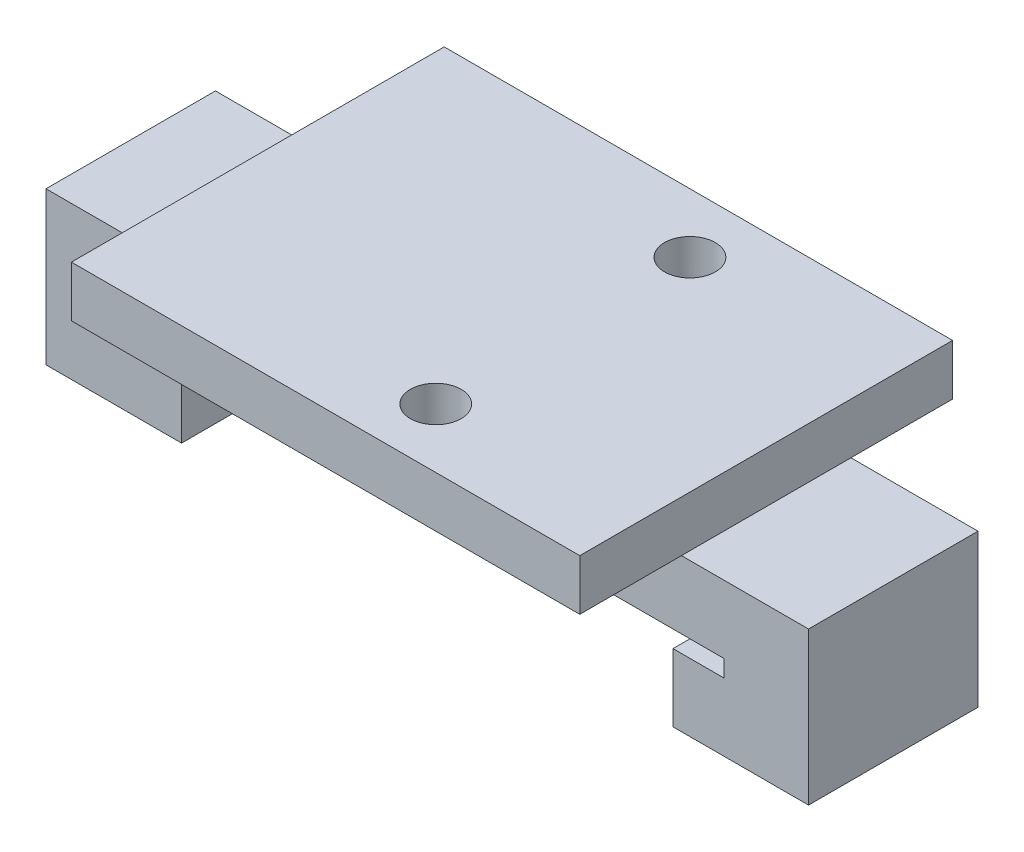
ISO-10303-21;
HEADER;
FILE_DESCRIPTION(('STEP AP214'),'2;1');
FILE_NAME('part.step','',(''),(''),'','','');
FILE_SCHEMA(('AUTOMOTIVE_DESIGN { 1 0 10303 214 1 1 1 1 }'));
ENDSEC;
DATA;
#1=APPLICATION_CONTEXT('core data for automotive mechanical design processes');
#2=APPLICATION_PROTOCOL_DEFINITION('international standard','automotive_design',2000,#1);
#3=PRODUCT_CONTEXT('',#1,'mechanical');
#4=PRODUCT('Part','Part','',(#3));
#5=PRODUCT_RELATED_PRODUCT_CATEGORY('part','',(#4));
#6=PRODUCT_DEFINITION_FORMATION('','',#4);
#7=PRODUCT_DEFINITION_CONTEXT('part definition',#1,'design');
#8=PRODUCT_DEFINITION('design','',#6,#7);
#9=PRODUCT_DEFINITION_SHAPE('','',#8);
#10=(LENGTH_UNIT() NAMED_UNIT(*) SI_UNIT(.MILLI.,.METRE.));
#11=(NAMED_UNIT(*) PLANE_ANGLE_UNIT() SI_UNIT($,.RADIAN.));
#12=(NAMED_UNIT(*) SI_UNIT($,.STERADIAN.) SOLID_ANGLE_UNIT());
#13=UNCERTAINTY_MEASURE_WITH_UNIT(LENGTH_MEASURE(1.E-05),#10,'distance_accuracy_value','');
#14=(GEOMETRIC_REPRESENTATION_CONTEXT(3) GLOBAL_UNCERTAINTY_ASSIGNED_CONTEXT((#13)) GLOBAL_UNIT_ASSIGNED_CONTEXT((#10,
#11,#12)) REPRESENTATION_CONTEXT('',''));
#15=CARTESIAN_POINT('',(0.,0.,0.));
#16=DIRECTION('',(0.,0.,1.));
#17=DIRECTION('',(1.,0.,0.));
#18=AXIS2_PLACEMENT_3D('',#15,#16,#17);
#19=CARTESIAN_POINT('',(-22.5,4.,10.));
#20=DIRECTION('',(0.,-1.,0.));
#21=DIRECTION('',(1.,0.,0.));
#22=AXIS2_PLACEMENT_3D('',#19,#20,#21);
#23=PLANE('',#22);
#24=DIRECTION('',(0.,0.,-1.));
#25=VECTOR('',#24,1.);
#26=CARTESIAN_POINT('',(15.,4.,16.));
#27=LINE('',#26,#25);
#28=CARTESIAN_POINT('',(15.,4.,10.));
#29=VERTEX_POINT('',#28);
#30=CARTESIAN_POINT('',(15.,4.,0.));
#31=VERTEX_POINT('',#30);
#32=EDGE_CURVE('E11',#29,#31,#27,.T.);
#33=ORIENTED_EDGE('',*,*,#32,.F.);
#34=DIRECTION('',(-1.,0.,0.));
#35=VECTOR('',#34,1.);
#36=CARTESIAN_POINT('',(-22.5,4.,10.));
#37=LINE('',#36,#35);
#38=CARTESIAN_POINT('',(22.5,4.,10.));
#39=VERTEX_POINT('',#38);
#40=EDGE_CURVE('E233',#39,#29,#37,.T.);
#41=ORIENTED_EDGE('',*,*,#40,.F.);
#42=DIRECTION('',(0.,0.,-1.));
#43=VECTOR('',#42,1.);
#44=CARTESIAN_POINT('',(22.5,4.,10.));
#45=LINE('',#44,#43);
#46=CARTESIAN_POINT('',(22.5,4.,0.));
#47=VERTEX_POINT('',#46);
#48=EDGE_CURVE('E309',#39,#47,#45,.T.);
#49=ORIENTED_EDGE('',*,*,#48,.T.);
#50=DIRECTION('',(-1.,0.,0.));
#51=VECTOR('',#50,1.);
#52=CARTESIAN_POINT('',(-22.5,4.,0.));
#53=LINE('',#52,#51);
#54=EDGE_CURVE('E268',#47,#31,#53,.T.);
#55=ORIENTED_EDGE('',*,*,#54,.T.);
#56=EDGE_LOOP('',(#33,#41,#49,#55));
#57=FACE_BOUND('',#56,.T.);
#58=ADVANCED_FACE('F43',(#57),#23,.F.);
#59=DIRECTION('',(0.,0.,1.));
#60=VECTOR('',#59,1.);
#61=CARTESIAN_POINT('',(-15.,4.,16.));
#62=LINE('',#61,#60);
#63=CARTESIAN_POINT('',(-15.,4.,0.));
#64=VERTEX_POINT('',#63);
#65=CARTESIAN_POINT('',(-15.,4.,10.));
#66=VERTEX_POINT('',#65);
#67=EDGE_CURVE('E53',#64,#66,#62,.T.);
#68=ORIENTED_EDGE('',*,*,#67,.F.);
#69=CARTESIAN_POINT('',(-22.5,4.,0.));
#70=VERTEX_POINT('',#69);
#71=EDGE_CURVE('E267',#64,#70,#53,.T.);
#72=ORIENTED_EDGE('',*,*,#71,.T.);
#73=DIRECTION('',(0.,0.,-1.));
#74=VECTOR('',#73,1.);
#75=CARTESIAN_POINT('',(-22.5,4.,10.));
#76=LINE('',#75,#74);
#77=CARTESIAN_POINT('',(-22.5,4.,10.));
#78=VERTEX_POINT('',#77);
#79=EDGE_CURVE('E305',#78,#70,#76,.T.);
#80=ORIENTED_EDGE('',*,*,#79,.F.);
#81=EDGE_CURVE('E232',#66,#78,#37,.T.);
#82=ORIENTED_EDGE('',*,*,#81,.F.);
#83=EDGE_LOOP('',(#68,#72,#80,#82));
#84=FACE_BOUND('',#83,.T.);
#85=ADVANCED_FACE('F393',(#84),#23,.F.);
#86=CARTESIAN_POINT('',(17.5,0.,10.));
#87=DIRECTION('',(0.,1.,0.));
#88=DIRECTION('',(-1.,0.,0.));
#89=AXIS2_PLACEMENT_3D('',#86,#87,#88);
#90=PLANE('',#89);
#91=DIRECTION('',(1.,0.,0.));
#92=VECTOR('',#91,1.);
#93=CARTESIAN_POINT('',(17.5,0.,0.));
#94=LINE('',#93,#92);
#95=CARTESIAN_POINT('',(-17.5,0.,0.));
#96=VERTEX_POINT('',#95);
#97=CARTESIAN_POINT('',(17.5,0.,0.));
#98=VERTEX_POINT('',#97);
#99=EDGE_CURVE('E201',#96,#98,#94,.T.);
#100=ORIENTED_EDGE('',*,*,#99,.T.);
#101=DIRECTION('',(0.,0.,-1.));
#102=VECTOR('',#101,1.);
#103=CARTESIAN_POINT('',(17.5,0.,10.));
#104=LINE('',#103,#102);
#105=CARTESIAN_POINT('',(17.5,0.,10.));
#106=VERTEX_POINT('',#105);
#107=EDGE_CURVE('E328',#106,#98,#104,.T.);
#108=ORIENTED_EDGE('',*,*,#107,.F.);
#109=DIRECTION('',(1.,0.,0.));
#110=VECTOR('',#109,1.);
#111=CARTESIAN_POINT('',(17.5,0.,10.));
#112=LINE('',#111,#110);
#113=CARTESIAN_POINT('',(-17.5,0.,10.));
#114=VERTEX_POINT('',#113);
#115=EDGE_CURVE('E212',#114,#106,#112,.T.);
#116=ORIENTED_EDGE('',*,*,#115,.F.);
#117=DIRECTION('',(0.,0.,-1.));
#118=VECTOR('',#117,1.);
#119=CARTESIAN_POINT('',(-17.5,0.,10.));
#120=LINE('',#119,#118);
#121=EDGE_CURVE('E251',#114,#96,#120,.T.);
#122=ORIENTED_EDGE('',*,*,#121,.T.);
#123=EDGE_LOOP('',(#100,#108,#116,#122));
#124=FACE_BOUND('',#123,.T.);
#125=ADVANCED_FACE('F45',(#124),#90,.F.);
#126=CARTESIAN_POINT('',(17.5,-1.,10.));
#127=DIRECTION('',(1.,0.,0.));
#128=DIRECTION('',(0.,0.,-1.));
#129=AXIS2_PLACEMENT_3D('',#126,#127,#128);
#130=PLANE('',#129);
#131=DIRECTION('',(0.,-1.,0.));
#132=VECTOR('',#131,1.);
#133=CARTESIAN_POINT('',(17.5,-1.,0.));
#134=LINE('',#133,#132);
#135=CARTESIAN_POINT('',(17.5,-1.,0.));
#136=VERTEX_POINT('',#135);
#137=EDGE_CURVE('E206',#98,#136,#134,.T.);
#138=ORIENTED_EDGE('',*,*,#137,.T.);
#139=DIRECTION('',(0.,0.,-1.));
#140=VECTOR('',#139,1.);
#141=CARTESIAN_POINT('',(17.5,-1.,10.));
#142=LINE('',#141,#140);
#143=CARTESIAN_POINT('',(17.5,-1.,10.));
#144=VERTEX_POINT('',#143);
#145=EDGE_CURVE('E325',#144,#136,#142,.T.);
#146=ORIENTED_EDGE('',*,*,#145,.F.);
#147=DIRECTION('',(0.,-1.,0.));
#148=VECTOR('',#147,1.);
#149=CARTESIAN_POINT('',(17.5,-1.,10.));
#150=LINE('',#149,#148);
#151=EDGE_CURVE('E216',#106,#144,#150,.T.);
#152=ORIENTED_EDGE('',*,*,#151,.F.);
#153=ORIENTED_EDGE('',*,*,#107,.T.);
#154=EDGE_LOOP('',(#138,#146,#152,#153));
#155=FACE_BOUND('',#154,.T.);
#156=ADVANCED_FACE('F425',(#155),#130,.F.);
#157=CARTESIAN_POINT('',(14.5,-1.,10.));
#158=DIRECTION('',(0.,-1.,0.));
#159=DIRECTION('',(0.,0.,-1.));
#160=AXIS2_PLACEMENT_3D('',#157,#158,#159);
#161=PLANE('',#160);
#162=DIRECTION('',(-1.,0.,0.));
#163=VECTOR('',#162,1.);
#164=CARTESIAN_POINT('',(14.5,-1.,0.));
#165=LINE('',#164,#163);
#166=CARTESIAN_POINT('',(14.5,-1.,0.));
#167=VERTEX_POINT('',#166);
#168=EDGE_CURVE('E255',#136,#167,#165,.T.);
#169=ORIENTED_EDGE('',*,*,#168,.T.);
#170=DIRECTION('',(0.,0.,-1.));
#171=VECTOR('',#170,1.);
#172=CARTESIAN_POINT('',(14.5,-1.,10.));
#173=LINE('',#172,#171);
#174=CARTESIAN_POINT('',(14.5,-1.,10.));
#175=VERTEX_POINT('',#174);
#176=EDGE_CURVE('E321',#175,#167,#173,.T.);
#177=ORIENTED_EDGE('',*,*,#176,.F.);
#178=DIRECTION('',(-1.,0.,0.));
#179=VECTOR('',#178,1.);
#180=CARTESIAN_POINT('',(14.5,-1.,10.));
#181=LINE('',#180,#179);
#182=EDGE_CURVE('E220',#144,#175,#181,.T.);
#183=ORIENTED_EDGE('',*,*,#182,.F.);
#184=ORIENTED_EDGE('',*,*,#145,.T.);
#185=EDGE_LOOP('',(#169,#177,#183,#184));
#186=FACE_BOUND('',#185,.T.);
#187=ADVANCED_FACE('F428',(#186),#161,.F.);
#188=CARTESIAN_POINT('',(14.5,-5.,10.));
#189=DIRECTION('',(1.,0.,0.));
#190=DIRECTION('',(0.,0.,-1.));
#191=AXIS2_PLACEMENT_3D('',#188,#189,#190);
#192=PLANE('',#191);
#193=DIRECTION('',(0.,-1.,0.));
#194=VECTOR('',#193,1.);
#195=CARTESIAN_POINT('',(14.5,-5.,0.));
#196=LINE('',#195,#194);
#197=CARTESIAN_POINT('',(14.5,-5.,0.));
#198=VERTEX_POINT('',#197);
#199=EDGE_CURVE('E258',#167,#198,#196,.T.);
#200=ORIENTED_EDGE('',*,*,#199,.T.);
#201=DIRECTION('',(0.,0.,-1.));
#202=VECTOR('',#201,1.);
#203=CARTESIAN_POINT('',(14.5,-5.,10.));
#204=LINE('',#203,#202);
#205=CARTESIAN_POINT('',(14.5,-5.,10.));
#206=VERTEX_POINT('',#205);
#207=EDGE_CURVE('E317',#206,#198,#204,.T.);
#208=ORIENTED_EDGE('',*,*,#207,.F.);
#209=DIRECTION('',(0.,-1.,0.));
#210=VECTOR('',#209,1.);
#211=CARTESIAN_POINT('',(14.5,-5.,10.));
#212=LINE('',#211,#210);
#213=EDGE_CURVE('E223',#175,#206,#212,.T.);
#214=ORIENTED_EDGE('',*,*,#213,.F.);
#215=ORIENTED_EDGE('',*,*,#176,.T.);
#216=EDGE_LOOP('',(#200,#208,#214,#215));
#217=FACE_BOUND('',#216,.T.);
#218=ADVANCED_FACE('F435',(#217),#192,.F.);
#219=CARTESIAN_POINT('',(22.5,-5.,10.));
#220=DIRECTION('',(0.,1.,0.));
#221=DIRECTION('',(-1.,0.,0.));
#222=AXIS2_PLACEMENT_3D('',#219,#220,#221);
#223=PLANE('',#222);
#224=DIRECTION('',(1.,0.,0.));
#225=VECTOR('',#224,1.);
#226=CARTESIAN_POINT('',(22.5,-5.,0.));
#227=LINE('',#226,#225);
#228=CARTESIAN_POINT('',(22.5,-5.,0.));
#229=VERTEX_POINT('',#228);
#230=EDGE_CURVE('E261',#198,#229,#227,.T.);
#231=ORIENTED_EDGE('',*,*,#230,.T.);
#232=DIRECTION('',(0.,0.,-1.));
#233=VECTOR('',#232,1.);
#234=CARTESIAN_POINT('',(22.5,-5.,10.));
#235=LINE('',#234,#233);
#236=CARTESIAN_POINT('',(22.5,-5.,10.));
#237=VERTEX_POINT('',#236);
#238=EDGE_CURVE('E313',#237,#229,#235,.T.);
#239=ORIENTED_EDGE('',*,*,#238,.F.);
#240=DIRECTION('',(1.,0.,0.));
#241=VECTOR('',#240,1.);
#242=CARTESIAN_POINT('',(22.5,-5.,10.));
#243=LINE('',#242,#241);
#244=EDGE_CURVE('E226',#206,#237,#243,.T.);
#245=ORIENTED_EDGE('',*,*,#244,.F.);
#246=ORIENTED_EDGE('',*,*,#207,.T.);
#247=EDGE_LOOP('',(#231,#239,#245,#246));
#248=FACE_BOUND('',#247,.T.);
#249=ADVANCED_FACE('F438',(#248),#223,.F.);
#250=CARTESIAN_POINT('',(22.5,4.,10.));
#251=DIRECTION('',(-1.,0.,0.));
#252=DIRECTION('',(0.,0.,1.));
#253=AXIS2_PLACEMENT_3D('',#250,#251,#252);
#254=PLANE('',#253);
#255=DIRECTION('',(0.,1.,0.));
#256=VECTOR('',#255,1.);
#257=CARTESIAN_POINT('',(22.5,4.,0.));
#258=LINE('',#257,#256);
#259=EDGE_CURVE('E264',#229,#47,#258,.T.);
#260=ORIENTED_EDGE('',*,*,#259,.T.);
#261=ORIENTED_EDGE('',*,*,#48,.F.);
#262=DIRECTION('',(0.,1.,0.));
#263=VECTOR('',#262,1.);
#264=CARTESIAN_POINT('',(22.5,4.,10.));
#265=LINE('',#264,#263);
#266=EDGE_CURVE('E229',#237,#39,#265,.T.);
#267=ORIENTED_EDGE('',*,*,#266,.F.);
#268=ORIENTED_EDGE('',*,*,#238,.T.);
#269=EDGE_LOOP('',(#260,#261,#267,#268));
#270=FACE_BOUND('',#269,.T.);
#271=ADVANCED_FACE('F443',(#270),#254,.F.);
#272=CARTESIAN_POINT('',(-22.5,-5.,10.));
#273=DIRECTION('',(1.,0.,0.));
#274=DIRECTION('',(0.,0.,-1.));
#275=AXIS2_PLACEMENT_3D('',#272,#273,#274);
#276=PLANE('',#275);
#277=DIRECTION('',(0.,-1.,0.));
#278=VECTOR('',#277,1.);
#279=CARTESIAN_POINT('',(-22.5,-5.,0.));
#280=LINE('',#279,#278);
#281=CARTESIAN_POINT('',(-22.5,-5.,0.));
#282=VERTEX_POINT('',#281);
#283=EDGE_CURVE('E271',#70,#282,#280,.T.);
#284=ORIENTED_EDGE('',*,*,#283,.T.);
#285=DIRECTION('',(0.,0.,-1.));
#286=VECTOR('',#285,1.);
#287=CARTESIAN_POINT('',(-22.5,-5.,10.));
#288=LINE('',#287,#286);
#289=CARTESIAN_POINT('',(-22.5,-5.,10.));
#290=VERTEX_POINT('',#289);
#291=EDGE_CURVE('E301',#290,#282,#288,.T.);
#292=ORIENTED_EDGE('',*,*,#291,.F.);
#293=DIRECTION('',(0.,-1.,0.));
#294=VECTOR('',#293,1.);
#295=CARTESIAN_POINT('',(-22.5,0.,10.));
#296=LINE('',#295,#294);
#297=EDGE_CURVE('E236',#78,#290,#296,.T.);
#298=ORIENTED_EDGE('',*,*,#297,.F.);
#299=ORIENTED_EDGE('',*,*,#79,.T.);
#300=EDGE_LOOP('',(#284,#292,#298,#299));
#301=FACE_BOUND('',#300,.T.);
#302=ADVANCED_FACE('F396',(#301),#276,.F.);
#303=CARTESIAN_POINT('',(-14.5,-5.,10.));
#304=DIRECTION('',(0.,1.,0.));
#305=DIRECTION('',(0.,0.,1.));
#306=AXIS2_PLACEMENT_3D('',#303,#304,#305);
#307=PLANE('',#306);
#308=DIRECTION('',(1.,0.,0.));
#309=VECTOR('',#308,1.);
#310=CARTESIAN_POINT('',(-14.5,-5.,0.));
#311=LINE('',#310,#309);
#312=CARTESIAN_POINT('',(-14.5,-5.,0.));
#313=VERTEX_POINT('',#312);
#314=EDGE_CURVE('E275',#282,#313,#311,.T.);
#315=ORIENTED_EDGE('',*,*,#314,.T.);
#316=DIRECTION('',(0.,0.,-1.));
#317=VECTOR('',#316,1.);
#318=CARTESIAN_POINT('',(-14.5,-5.,10.));
#319=LINE('',#318,#317);
#320=CARTESIAN_POINT('',(-14.5,-5.,10.));
#321=VERTEX_POINT('',#320);
#322=EDGE_CURVE('E297',#321,#313,#319,.T.);
#323=ORIENTED_EDGE('',*,*,#322,.F.);
#324=DIRECTION('',(1.,0.,0.));
#325=VECTOR('',#324,1.);
#326=CARTESIAN_POINT('',(-14.5,-5.,10.));
#327=LINE('',#326,#325);
#328=EDGE_CURVE('E240',#290,#321,#327,.T.);
#329=ORIENTED_EDGE('',*,*,#328,.F.);
#330=ORIENTED_EDGE('',*,*,#291,.T.);
#331=EDGE_LOOP('',(#315,#323,#329,#330));
#332=FACE_BOUND('',#331,.T.);
#333=ADVANCED_FACE('F401',(#332),#307,.F.);
#334=CARTESIAN_POINT('',(-14.5,-1.,10.));
#335=DIRECTION('',(-1.,0.,0.));
#336=DIRECTION('',(0.,0.,1.));
#337=AXIS2_PLACEMENT_3D('',#334,#335,#336);
#338=PLANE('',#337);
#339=DIRECTION('',(0.,1.,0.));
#340=VECTOR('',#339,1.);
#341=CARTESIAN_POINT('',(-14.5,-1.,0.));
#342=LINE('',#341,#340);
#343=CARTESIAN_POINT('',(-14.5,-1.,0.));
#344=VERTEX_POINT('',#343);
#345=EDGE_CURVE('E278',#313,#344,#342,.T.);
#346=ORIENTED_EDGE('',*,*,#345,.T.);
#347=DIRECTION('',(0.,0.,-1.));
#348=VECTOR('',#347,1.);
#349=CARTESIAN_POINT('',(-14.5,-1.,10.));
#350=LINE('',#349,#348);
#351=CARTESIAN_POINT('',(-14.5,-1.,10.));
#352=VERTEX_POINT('',#351);
#353=EDGE_CURVE('E293',#352,#344,#350,.T.);
#354=ORIENTED_EDGE('',*,*,#353,.F.);
#355=DIRECTION('',(0.,1.,0.));
#356=VECTOR('',#355,1.);
#357=CARTESIAN_POINT('',(-14.5,-1.,10.));
#358=LINE('',#357,#356);
#359=EDGE_CURVE('E243',#321,#352,#358,.T.);
#360=ORIENTED_EDGE('',*,*,#359,.F.);
#361=ORIENTED_EDGE('',*,*,#322,.T.);
#362=EDGE_LOOP('',(#346,#354,#360,#361));
#363=FACE_BOUND('',#362,.T.);
#364=ADVANCED_FACE('F407',(#363),#338,.F.);
#365=CARTESIAN_POINT('',(-17.5,-1.,10.));
#366=DIRECTION('',(0.,-1.,0.));
#367=DIRECTION('',(0.,0.,-1.));
#368=AXIS2_PLACEMENT_3D('',#365,#366,#367);
#369=PLANE('',#368);
#370=DIRECTION('',(-1.,0.,0.));
#371=VECTOR('',#370,1.);
#372=CARTESIAN_POINT('',(-17.5,-1.,0.));
#373=LINE('',#372,#371);
#374=CARTESIAN_POINT('',(-17.5,-1.,0.));
#375=VERTEX_POINT('',#374);
#376=EDGE_CURVE('E281',#344,#375,#373,.T.);
#377=ORIENTED_EDGE('',*,*,#376,.T.);
#378=DIRECTION('',(0.,0.,-1.));
#379=VECTOR('',#378,1.);
#380=CARTESIAN_POINT('',(-17.5,-1.,10.));
#381=LINE('',#380,#379);
#382=CARTESIAN_POINT('',(-17.5,-1.,10.));
#383=VERTEX_POINT('',#382);
#384=EDGE_CURVE('E289',#383,#375,#381,.T.);
#385=ORIENTED_EDGE('',*,*,#384,.F.);
#386=DIRECTION('',(-1.,0.,0.));
#387=VECTOR('',#386,1.);
#388=CARTESIAN_POINT('',(-17.5,-1.,10.));
#389=LINE('',#388,#387);
#390=EDGE_CURVE('E246',#352,#383,#389,.T.);
#391=ORIENTED_EDGE('',*,*,#390,.F.);
#392=ORIENTED_EDGE('',*,*,#353,.T.);
#393=EDGE_LOOP('',(#377,#385,#391,#392));
#394=FACE_BOUND('',#393,.T.);
#395=ADVANCED_FACE('F411',(#394),#369,.F.);
#396=CARTESIAN_POINT('',(-17.5,0.,10.));
#397=DIRECTION('',(-1.,0.,0.));
#398=DIRECTION('',(0.,0.,1.));
#399=AXIS2_PLACEMENT_3D('',#396,#397,#398);
#400=PLANE('',#399);
#401=DIRECTION('',(0.,1.,0.));
#402=VECTOR('',#401,1.);
#403=CARTESIAN_POINT('',(-17.5,0.,0.));
#404=LINE('',#403,#402);
#405=EDGE_CURVE('E217',#375,#96,#404,.T.);
#406=ORIENTED_EDGE('',*,*,#405,.T.);
#407=ORIENTED_EDGE('',*,*,#121,.F.);
#408=DIRECTION('',(0.,1.,0.));
#409=VECTOR('',#408,1.);
#410=CARTESIAN_POINT('',(-17.5,0.,10.));
#411=LINE('',#410,#409);
#412=EDGE_CURVE('E249',#383,#114,#411,.T.);
#413=ORIENTED_EDGE('',*,*,#412,.F.);
#414=ORIENTED_EDGE('',*,*,#384,.T.);
#415=EDGE_LOOP('',(#406,#407,#413,#414));
#416=FACE_BOUND('',#415,.T.);
#417=ADVANCED_FACE('F416',(#416),#400,.F.);
#418=CARTESIAN_POINT('',(0.,0.,10.));
#419=DIRECTION('',(0.,0.,1.));
#420=DIRECTION('',(1.,0.,0.));
#421=AXIS2_PLACEMENT_3D('',#418,#419,#420);
#422=PLANE('',#421);
#423=ORIENTED_EDGE('',*,*,#115,.T.);
#424=ORIENTED_EDGE('',*,*,#151,.T.);
#425=ORIENTED_EDGE('',*,*,#182,.T.);
#426=ORIENTED_EDGE('',*,*,#213,.T.);
#427=ORIENTED_EDGE('',*,*,#244,.T.);
#428=ORIENTED_EDGE('',*,*,#266,.T.);
#429=ORIENTED_EDGE('',*,*,#40,.T.);
#430=EDGE_CURVE('E237',#29,#66,#37,.T.);
#431=ORIENTED_EDGE('',*,*,#430,.T.);
#432=ORIENTED_EDGE('',*,*,#81,.T.);
#433=ORIENTED_EDGE('',*,*,#297,.T.);
#434=ORIENTED_EDGE('',*,*,#328,.T.);
#435=ORIENTED_EDGE('',*,*,#359,.T.);
#436=ORIENTED_EDGE('',*,*,#390,.T.);
#437=ORIENTED_EDGE('',*,*,#412,.T.);
#438=EDGE_LOOP('',(#423,#424,#425,#426,#427,#428,#429,#431,#432,#433,#434,#435,#436,#437));
#439=FACE_BOUND('',#438,.T.);
#440=ADVANCED_FACE('F390',(#439),#422,.T.);
#441=CARTESIAN_POINT('',(0.,0.,0.));
#442=DIRECTION('',(0.,0.,1.));
#443=DIRECTION('',(1.,0.,0.));
#444=AXIS2_PLACEMENT_3D('',#441,#442,#443);
#445=PLANE('',#444);
#446=ORIENTED_EDGE('',*,*,#99,.F.);
#447=ORIENTED_EDGE('',*,*,#405,.F.);
#448=ORIENTED_EDGE('',*,*,#376,.F.);
#449=ORIENTED_EDGE('',*,*,#345,.F.);
#450=ORIENTED_EDGE('',*,*,#314,.F.);
#451=ORIENTED_EDGE('',*,*,#283,.F.);
#452=ORIENTED_EDGE('',*,*,#71,.F.);
#453=EDGE_CURVE('E272',#31,#64,#53,.T.);
#454=ORIENTED_EDGE('',*,*,#453,.F.);
#455=ORIENTED_EDGE('',*,*,#54,.F.);
#456=ORIENTED_EDGE('',*,*,#259,.F.);
#457=ORIENTED_EDGE('',*,*,#230,.F.);
#458=ORIENTED_EDGE('',*,*,#199,.F.);
#459=ORIENTED_EDGE('',*,*,#168,.F.);
#460=ORIENTED_EDGE('',*,*,#137,.F.);
#461=EDGE_LOOP('',(#446,#447,#448,#449,#450,#451,#452,#454,#455,#456,#457,#458,#459,#460));
#462=FACE_BOUND('',#461,.T.);
#463=ADVANCED_FACE('F422',(#462),#445,.F.);
#464=CARTESIAN_POINT('',(0.,4.,0.));
#465=DIRECTION('',(0.,-1.,0.));
#466=DIRECTION('',(1.,0.,0.));
#467=AXIS2_PLACEMENT_3D('',#464,#465,#466);
#468=PLANE('',#467);
#469=CARTESIAN_POINT('',(2.99999999999999,4.,12.5));
#470=DIRECTION('',(0.,-1.,0.));
#471=DIRECTION('',(1.,0.,0.));
#472=AXIS2_PLACEMENT_3D('',#469,#470,#471);
#473=CIRCLE('',#472,1.5);
#474=CARTESIAN_POINT('',(4.49999999999999,4.,12.5));
#475=VERTEX_POINT('',#474);
#476=EDGE_CURVE('E355',#475,#475,#473,.T.);
#477=ORIENTED_EDGE('',*,*,#476,.F.);
#478=EDGE_LOOP('',(#477));
#479=FACE_BOUND('',#478,.T.);
#480=ORIENTED_EDGE('',*,*,#430,.F.);
#481=CARTESIAN_POINT('',(15.,4.,16.));
#482=VERTEX_POINT('',#481);
#483=EDGE_CURVE('E55',#482,#29,#27,.T.);
#484=ORIENTED_EDGE('',*,*,#483,.F.);
#485=DIRECTION('',(1.,0.,0.));
#486=VECTOR('',#485,1.);
#487=CARTESIAN_POINT('',(-15.,4.,16.));
#488=LINE('',#487,#486);
#489=CARTESIAN_POINT('',(-15.,4.,16.));
#490=VERTEX_POINT('',#489);
#491=EDGE_CURVE('E194',#490,#482,#488,.T.);
#492=ORIENTED_EDGE('',*,*,#491,.F.);
#493=EDGE_CURVE('E336',#66,#490,#62,.T.);
#494=ORIENTED_EDGE('',*,*,#493,.F.);
#495=EDGE_LOOP('',(#480,#484,#492,#494));
#496=FACE_BOUND('',#495,.T.);
#497=ADVANCED_FACE('F378',(#479,#496),#468,.T.);
#498=CARTESIAN_POINT('',(15.,7.,16.));
#499=DIRECTION('',(-1.,0.,0.));
#500=DIRECTION('',(0.,-1.,0.));
#501=AXIS2_PLACEMENT_3D('',#498,#499,#500);
#502=PLANE('',#501);
#503=ORIENTED_EDGE('',*,*,#483,.T.);
#504=ORIENTED_EDGE('',*,*,#32,.T.);
#505=CARTESIAN_POINT('',(15.,4.,-6.));
#506=VERTEX_POINT('',#505);
#507=EDGE_CURVE('E56',#31,#506,#27,.T.);
#508=ORIENTED_EDGE('',*,*,#507,.T.);
#509=DIRECTION('',(0.,-1.,0.));
#510=VECTOR('',#509,1.);
#511=CARTESIAN_POINT('',(15.,7.,-6.));
#512=LINE('',#511,#510);
#513=CARTESIAN_POINT('',(15.,7.,-6.));
#514=VERTEX_POINT('',#513);
#515=EDGE_CURVE('E177',#514,#506,#512,.T.);
#516=ORIENTED_EDGE('',*,*,#515,.F.);
#517=DIRECTION('',(0.,0.,-1.));
#518=VECTOR('',#517,1.);
#519=CARTESIAN_POINT('',(15.,7.,16.));
#520=LINE('',#519,#518);
#521=CARTESIAN_POINT('',(15.,7.,16.));
#522=VERTEX_POINT('',#521);
#523=EDGE_CURVE('E184',#522,#514,#520,.T.);
#524=ORIENTED_EDGE('',*,*,#523,.F.);
#525=DIRECTION('',(0.,-1.,0.));
#526=VECTOR('',#525,1.);
#527=CARTESIAN_POINT('',(15.,7.,16.));
#528=LINE('',#527,#526);
#529=EDGE_CURVE('E352',#522,#482,#528,.T.);
#530=ORIENTED_EDGE('',*,*,#529,.T.);
#531=EDGE_LOOP('',(#503,#504,#508,#516,#524,#530));
#532=FACE_BOUND('',#531,.T.);
#533=ADVANCED_FACE('F197',(#532),#502,.F.);
#534=CARTESIAN_POINT('',(-15.,7.,-6.));
#535=DIRECTION('',(0.,0.,1.));
#536=DIRECTION('',(1.,0.,0.));
#537=AXIS2_PLACEMENT_3D('',#534,#535,#536);
#538=PLANE('',#537);
#539=DIRECTION('',(-1.,0.,0.));
#540=VECTOR('',#539,1.);
#541=CARTESIAN_POINT('',(-15.,4.,-6.));
#542=LINE('',#541,#540);
#543=CARTESIAN_POINT('',(-15.,4.,-6.));
#544=VERTEX_POINT('',#543);
#545=EDGE_CURVE('E343',#506,#544,#542,.T.);
#546=ORIENTED_EDGE('',*,*,#545,.T.);
#547=DIRECTION('',(0.,-1.,0.));
#548=VECTOR('',#547,1.);
#549=CARTESIAN_POINT('',(-15.,7.,-6.));
#550=LINE('',#549,#548);
#551=CARTESIAN_POINT('',(-15.,7.,-6.));
#552=VERTEX_POINT('',#551);
#553=EDGE_CURVE('E179',#552,#544,#550,.T.);
#554=ORIENTED_EDGE('',*,*,#553,.F.);
#555=DIRECTION('',(-1.,0.,0.));
#556=VECTOR('',#555,1.);
#557=CARTESIAN_POINT('',(-15.,7.,-6.));
#558=LINE('',#557,#556);
#559=EDGE_CURVE('E173',#514,#552,#558,.T.);
#560=ORIENTED_EDGE('',*,*,#559,.F.);
#561=ORIENTED_EDGE('',*,*,#515,.T.);
#562=EDGE_LOOP('',(#546,#554,#560,#561));
#563=FACE_BOUND('',#562,.T.);
#564=ADVANCED_FACE('F175',(#563),#538,.F.);
#565=CARTESIAN_POINT('',(-15.,7.,16.));
#566=DIRECTION('',(1.,0.,0.));
#567=DIRECTION('',(0.,1.,0.));
#568=AXIS2_PLACEMENT_3D('',#565,#566,#567);
#569=PLANE('',#568);
#570=EDGE_CURVE('E335',#544,#64,#62,.T.);
#571=ORIENTED_EDGE('',*,*,#570,.T.);
#572=ORIENTED_EDGE('',*,*,#67,.T.);
#573=ORIENTED_EDGE('',*,*,#493,.T.);
#574=DIRECTION('',(0.,-1.,0.));
#575=VECTOR('',#574,1.);
#576=CARTESIAN_POINT('',(-15.,7.,16.));
#577=LINE('',#576,#575);
#578=CARTESIAN_POINT('',(-15.,7.,16.));
#579=VERTEX_POINT('',#578);
#580=EDGE_CURVE('E208',#579,#490,#577,.T.);
#581=ORIENTED_EDGE('',*,*,#580,.F.);
#582=DIRECTION('',(0.,0.,1.));
#583=VECTOR('',#582,1.);
#584=CARTESIAN_POINT('',(-15.,7.,16.));
#585=LINE('',#584,#583);
#586=EDGE_CURVE('E183',#552,#579,#585,.T.);
#587=ORIENTED_EDGE('',*,*,#586,.F.);
#588=ORIENTED_EDGE('',*,*,#553,.T.);
#589=EDGE_LOOP('',(#571,#572,#573,#581,#587,#588));
#590=FACE_BOUND('',#589,.T.);
#591=ADVANCED_FACE('F515',(#590),#569,.F.);
#592=CARTESIAN_POINT('',(-15.,7.,16.));
#593=DIRECTION('',(0.,0.,-1.));
#594=DIRECTION('',(-1.,0.,0.));
#595=AXIS2_PLACEMENT_3D('',#592,#593,#594);
#596=PLANE('',#595);
#597=ORIENTED_EDGE('',*,*,#491,.T.);
#598=ORIENTED_EDGE('',*,*,#529,.F.);
#599=DIRECTION('',(1.,0.,0.));
#600=VECTOR('',#599,1.);
#601=CARTESIAN_POINT('',(-15.,7.,16.));
#602=LINE('',#601,#600);
#603=EDGE_CURVE('E189',#579,#522,#602,.T.);
#604=ORIENTED_EDGE('',*,*,#603,.F.);
#605=ORIENTED_EDGE('',*,*,#580,.T.);
#606=EDGE_LOOP('',(#597,#598,#604,#605));
#607=FACE_BOUND('',#606,.T.);
#608=ADVANCED_FACE('F525',(#607),#596,.F.);
#609=CARTESIAN_POINT('',(0.,7.,0.));
#610=DIRECTION('',(0.,-1.,0.));
#611=DIRECTION('',(1.,0.,0.));
#612=AXIS2_PLACEMENT_3D('',#609,#610,#611);
#613=PLANE('',#612);
#614=CARTESIAN_POINT('',(2.99999999999999,7.,-2.5));
#615=DIRECTION('',(0.,1.,0.));
#616=DIRECTION('',(-1.,0.,0.));
#617=AXIS2_PLACEMENT_3D('',#614,#615,#616);
#618=CIRCLE('',#617,1.5);
#619=CARTESIAN_POINT('',(1.5,7.,-2.5));
#620=VERTEX_POINT('',#619);
#621=EDGE_CURVE('E363',#620,#620,#618,.T.);
#622=ORIENTED_EDGE('',*,*,#621,.F.);
#623=EDGE_LOOP('',(#622));
#624=FACE_BOUND('',#623,.T.);
#625=CARTESIAN_POINT('',(2.99999999999999,7.,12.5));
#626=DIRECTION('',(0.,1.,0.));
#627=DIRECTION('',(-1.,0.,0.));
#628=AXIS2_PLACEMENT_3D('',#625,#626,#627);
#629=CIRCLE('',#628,1.5);
#630=CARTESIAN_POINT('',(1.5,7.,12.5));
#631=VERTEX_POINT('',#630);
#632=EDGE_CURVE('E359',#631,#631,#629,.T.);
#633=ORIENTED_EDGE('',*,*,#632,.F.);
#634=EDGE_LOOP('',(#633));
#635=FACE_BOUND('',#634,.T.);
#636=ORIENTED_EDGE('',*,*,#523,.T.);
#637=ORIENTED_EDGE('',*,*,#559,.T.);
#638=ORIENTED_EDGE('',*,*,#586,.T.);
#639=ORIENTED_EDGE('',*,*,#603,.T.);
#640=EDGE_LOOP('',(#636,#637,#638,#639));
#641=FACE_BOUND('',#640,.T.);
#642=ADVANCED_FACE('F187',(#624,#635,#641),#613,.F.);
#643=CARTESIAN_POINT('',(2.99999999999999,4.,-2.5));
#644=DIRECTION('',(0.,-1.,0.));
#645=DIRECTION('',(1.,0.,0.));
#646=AXIS2_PLACEMENT_3D('',#643,#644,#645);
#647=CIRCLE('',#646,1.5);
#648=CARTESIAN_POINT('',(4.49999999999999,4.,-2.5));
#649=VERTEX_POINT('',#648);
#650=EDGE_CURVE('E47',#649,#649,#647,.T.);
#651=ORIENTED_EDGE('',*,*,#650,.F.);
#652=EDGE_LOOP('',(#651));
#653=FACE_BOUND('',#652,.T.);
#654=ORIENTED_EDGE('',*,*,#507,.F.);
#655=ORIENTED_EDGE('',*,*,#453,.T.);
#656=ORIENTED_EDGE('',*,*,#570,.F.);
#657=ORIENTED_EDGE('',*,*,#545,.F.);
#658=EDGE_LOOP('',(#654,#655,#656,#657));
#659=FACE_BOUND('',#658,.T.);
#660=ADVANCED_FACE('F374',(#653,#659),#468,.T.);
#661=CARTESIAN_POINT('',(3.,2.,-2.5));
#662=DIRECTION('',(0.,1.,0.));
#663=DIRECTION('',(-1.,0.,0.));
#664=AXIS2_PLACEMENT_3D('',#661,#662,#663);
#665=CYLINDRICAL_SURFACE('',#664,1.5);
#666=ORIENTED_EDGE('',*,*,#650,.T.);
#667=EDGE_LOOP('',(#666));
#668=FACE_BOUND('',#667,.T.);
#669=ORIENTED_EDGE('',*,*,#621,.T.);
#670=EDGE_LOOP('',(#669));
#671=FACE_BOUND('',#670,.T.);
#672=ADVANCED_FACE('F372',(#668,#671),#665,.F.);
#673=CARTESIAN_POINT('',(3.,2.,12.5));
#674=DIRECTION('',(0.,1.,0.));
#675=DIRECTION('',(-1.,0.,0.));
#676=AXIS2_PLACEMENT_3D('',#673,#674,#675);
#677=CYLINDRICAL_SURFACE('',#676,1.5);
#678=ORIENTED_EDGE('',*,*,#476,.T.);
#679=EDGE_LOOP('',(#678));
#680=FACE_BOUND('',#679,.T.);
#681=ORIENTED_EDGE('',*,*,#632,.T.);
#682=EDGE_LOOP('',(#681));
#683=FACE_BOUND('',#682,.T.);
#684=ADVANCED_FACE('F570',(#680,#683),#677,.F.);
#685=CLOSED_SHELL('',(#58,#85,#125,#156,#187,#218,#249,#271,#302,#333,#364,#395,#417,#440,#463,
#497,#533,#564,#591,#608,#642,#660,#672,#684));
#686=MANIFOLD_SOLID_BREP('B2',#685);
#687=ADVANCED_BREP_SHAPE_REPRESENTATION('',(#18,#686),#14);
#688=SHAPE_DEFINITION_REPRESENTATION(#9,#687);
ENDSEC;
END-ISO-10303-21;
